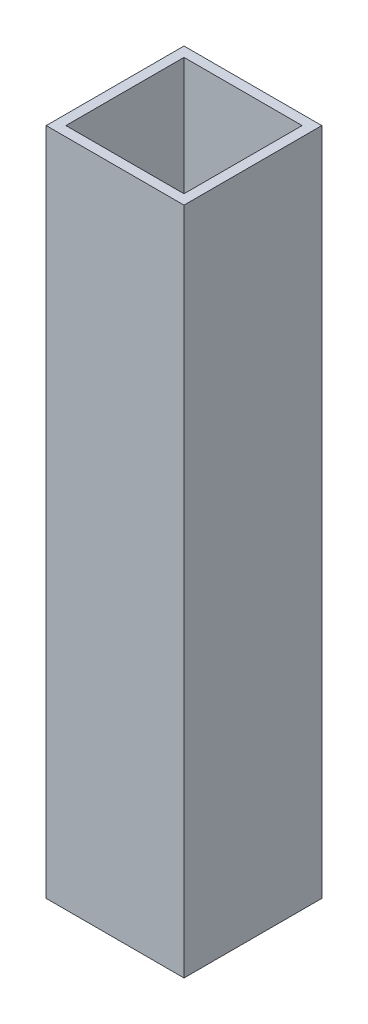
ISO-10303-21;
HEADER;
FILE_DESCRIPTION(('STEP AP214'),'2;1');
FILE_NAME('part.step','',(''),(''),'','','');
FILE_SCHEMA(('AUTOMOTIVE_DESIGN { 1 0 10303 214 1 1 1 1 }'));
ENDSEC;
DATA;
#1=APPLICATION_CONTEXT('core data for automotive mechanical design processes');
#2=APPLICATION_PROTOCOL_DEFINITION('international standard','automotive_design',2000,#1);
#3=PRODUCT_CONTEXT('',#1,'mechanical');
#4=PRODUCT('Part','Part','',(#3));
#5=PRODUCT_RELATED_PRODUCT_CATEGORY('part','',(#4));
#6=PRODUCT_DEFINITION_FORMATION('','',#4);
#7=PRODUCT_DEFINITION_CONTEXT('part definition',#1,'design');
#8=PRODUCT_DEFINITION('design','',#6,#7);
#9=PRODUCT_DEFINITION_SHAPE('','',#8);
#10=(LENGTH_UNIT() NAMED_UNIT(*) SI_UNIT(.MILLI.,.METRE.));
#11=(NAMED_UNIT(*) PLANE_ANGLE_UNIT() SI_UNIT($,.RADIAN.));
#12=(NAMED_UNIT(*) SI_UNIT($,.STERADIAN.) SOLID_ANGLE_UNIT());
#13=UNCERTAINTY_MEASURE_WITH_UNIT(LENGTH_MEASURE(1.E-05),#10,'distance_accuracy_value','');
#14=(GEOMETRIC_REPRESENTATION_CONTEXT(3) GLOBAL_UNCERTAINTY_ASSIGNED_CONTEXT((#13)) GLOBAL_UNIT_ASSIGNED_CONTEXT((#10,
#11,#12)) REPRESENTATION_CONTEXT('',''));
#15=CARTESIAN_POINT('',(0.,0.,0.));
#16=DIRECTION('',(0.,0.,1.));
#17=DIRECTION('',(1.,0.,0.));
#18=AXIS2_PLACEMENT_3D('',#15,#16,#17);
#19=CARTESIAN_POINT('',(1328.7375,260.35,-22.225));
#20=DIRECTION('',(0.,1.,0.));
#21=DIRECTION('',(-1.,0.,0.));
#22=AXIS2_PLACEMENT_3D('',#19,#20,#21);
#23=PLANE('',#22);
#24=DIRECTION('',(-1.,0.,0.));
#25=VECTOR('',#24,1.);
#26=CARTESIAN_POINT('',(2657.475,260.35,0.));
#27=LINE('',#26,#25);
#28=CARTESIAN_POINT('',(44.45,260.35,0.));
#29=VERTEX_POINT('',#28);
#30=CARTESIAN_POINT('',(0.,260.35,0.));
#31=VERTEX_POINT('',#30);
#32=EDGE_CURVE('E142',#29,#31,#27,.T.);
#33=ORIENTED_EDGE('',*,*,#32,.F.);
#34=DIRECTION('',(0.,0.,-1.));
#35=VECTOR('',#34,1.);
#36=CARTESIAN_POINT('',(44.45,260.35,-22.225));
#37=LINE('',#36,#35);
#38=CARTESIAN_POINT('',(44.45,260.35,-44.45));
#39=VERTEX_POINT('',#38);
#40=EDGE_CURVE('E146',#29,#39,#37,.T.);
#41=ORIENTED_EDGE('',*,*,#40,.T.);
#42=DIRECTION('',(-1.,0.,0.));
#43=VECTOR('',#42,1.);
#44=CARTESIAN_POINT('',(2657.475,260.35,-44.45));
#45=LINE('',#44,#43);
#46=CARTESIAN_POINT('',(0.,260.35,-44.45));
#47=VERTEX_POINT('',#46);
#48=EDGE_CURVE('E150',#39,#47,#45,.T.);
#49=ORIENTED_EDGE('',*,*,#48,.T.);
#50=DIRECTION('',(0.,0.,-1.));
#51=VECTOR('',#50,1.);
#52=CARTESIAN_POINT('',(0.,260.35,-22.225));
#53=LINE('',#52,#51);
#54=EDGE_CURVE('E153',#31,#47,#53,.T.);
#55=ORIENTED_EDGE('',*,*,#54,.F.);
#56=EDGE_LOOP('',(#33,#41,#49,#55));
#57=FACE_BOUND('',#56,.T.);
#58=DIRECTION('',(0.,0.,-1.));
#59=VECTOR('',#58,1.);
#60=CARTESIAN_POINT('',(41.275,260.35,-22.225));
#61=LINE('',#60,#59);
#62=CARTESIAN_POINT('',(41.275,260.35,-3.175));
#63=VERTEX_POINT('',#62);
#64=CARTESIAN_POINT('',(41.275,260.35,-41.275));
#65=VERTEX_POINT('',#64);
#66=EDGE_CURVE('E129',#63,#65,#61,.T.);
#67=ORIENTED_EDGE('',*,*,#66,.F.);
#68=DIRECTION('',(-1.,0.,0.));
#69=VECTOR('',#68,1.);
#70=CARTESIAN_POINT('',(2657.475,260.35,-3.175));
#71=LINE('',#70,#69);
#72=CARTESIAN_POINT('',(3.175,260.35,-3.175));
#73=VERTEX_POINT('',#72);
#74=EDGE_CURVE('E123',#63,#73,#71,.T.);
#75=ORIENTED_EDGE('',*,*,#74,.T.);
#76=DIRECTION('',(0.,0.,-1.));
#77=VECTOR('',#76,1.);
#78=CARTESIAN_POINT('',(3.175,260.35,-22.225));
#79=LINE('',#78,#77);
#80=CARTESIAN_POINT('',(3.175,260.35,-41.275));
#81=VERTEX_POINT('',#80);
#82=EDGE_CURVE('E105',#73,#81,#79,.T.);
#83=ORIENTED_EDGE('',*,*,#82,.T.);
#84=DIRECTION('',(-1.,0.,0.));
#85=VECTOR('',#84,1.);
#86=CARTESIAN_POINT('',(2657.475,260.35,-41.275));
#87=LINE('',#86,#85);
#88=EDGE_CURVE('E139',#65,#81,#87,.T.);
#89=ORIENTED_EDGE('',*,*,#88,.F.);
#90=EDGE_LOOP('',(#67,#75,#83,#89));
#91=FACE_BOUND('',#90,.T.);
#92=ADVANCED_FACE('F14',(#57,#91),#23,.T.);
#93=CARTESIAN_POINT('',(1328.7375,44.45,-22.225));
#94=DIRECTION('',(0.,1.,0.));
#95=DIRECTION('',(-1.,0.,0.));
#96=AXIS2_PLACEMENT_3D('',#93,#94,#95);
#97=PLANE('',#96);
#98=DIRECTION('',(-1.,0.,0.));
#99=VECTOR('',#98,1.);
#100=CARTESIAN_POINT('',(2657.475,44.45,0.));
#101=LINE('',#100,#99);
#102=CARTESIAN_POINT('',(44.45,44.45,0.));
#103=VERTEX_POINT('',#102);
#104=CARTESIAN_POINT('',(0.,44.45,0.));
#105=VERTEX_POINT('',#104);
#106=EDGE_CURVE('E158',#103,#105,#101,.T.);
#107=ORIENTED_EDGE('',*,*,#106,.T.);
#108=DIRECTION('',(0.,0.,-1.));
#109=VECTOR('',#108,1.);
#110=CARTESIAN_POINT('',(0.,44.45,-22.225));
#111=LINE('',#110,#109);
#112=CARTESIAN_POINT('',(0.,44.45,-44.45));
#113=VERTEX_POINT('',#112);
#114=EDGE_CURVE('E147',#105,#113,#111,.T.);
#115=ORIENTED_EDGE('',*,*,#114,.T.);
#116=DIRECTION('',(-1.,0.,0.));
#117=VECTOR('',#116,1.);
#118=CARTESIAN_POINT('',(2657.475,44.45,-44.45));
#119=LINE('',#118,#117);
#120=CARTESIAN_POINT('',(44.45,44.45,-44.45));
#121=VERTEX_POINT('',#120);
#122=EDGE_CURVE('E165',#121,#113,#119,.T.);
#123=ORIENTED_EDGE('',*,*,#122,.F.);
#124=DIRECTION('',(0.,0.,-1.));
#125=VECTOR('',#124,1.);
#126=CARTESIAN_POINT('',(44.45,44.45,-22.225));
#127=LINE('',#126,#125);
#128=EDGE_CURVE('E162',#103,#121,#127,.T.);
#129=ORIENTED_EDGE('',*,*,#128,.F.);
#130=EDGE_LOOP('',(#107,#115,#123,#129));
#131=FACE_BOUND('',#130,.T.);
#132=DIRECTION('',(-1.,0.,0.));
#133=VECTOR('',#132,1.);
#134=CARTESIAN_POINT('',(2657.475,44.45,-3.175));
#135=LINE('',#134,#133);
#136=CARTESIAN_POINT('',(41.275,44.45,-3.175));
#137=VERTEX_POINT('',#136);
#138=CARTESIAN_POINT('',(3.175,44.45,-3.175));
#139=VERTEX_POINT('',#138);
#140=EDGE_CURVE('E112',#137,#139,#135,.T.);
#141=ORIENTED_EDGE('',*,*,#140,.F.);
#142=DIRECTION('',(0.,0.,-1.));
#143=VECTOR('',#142,1.);
#144=CARTESIAN_POINT('',(41.275,44.45,-22.225));
#145=LINE('',#144,#143);
#146=CARTESIAN_POINT('',(41.275,44.45,-41.275));
#147=VERTEX_POINT('',#146);
#148=EDGE_CURVE('E119',#137,#147,#145,.T.);
#149=ORIENTED_EDGE('',*,*,#148,.T.);
#150=DIRECTION('',(-1.,0.,0.));
#151=VECTOR('',#150,1.);
#152=CARTESIAN_POINT('',(2657.475,44.45,-41.275));
#153=LINE('',#152,#151);
#154=CARTESIAN_POINT('',(3.175,44.45,-41.275));
#155=VERTEX_POINT('',#154);
#156=EDGE_CURVE('E46',#147,#155,#153,.T.);
#157=ORIENTED_EDGE('',*,*,#156,.T.);
#158=DIRECTION('',(0.,0.,-1.));
#159=VECTOR('',#158,1.);
#160=CARTESIAN_POINT('',(3.175,44.45,-22.225));
#161=LINE('',#160,#159);
#162=EDGE_CURVE('E103',#139,#155,#161,.T.);
#163=ORIENTED_EDGE('',*,*,#162,.F.);
#164=EDGE_LOOP('',(#141,#149,#157,#163));
#165=FACE_BOUND('',#164,.T.);
#166=ADVANCED_FACE('F121',(#131,#165),#97,.F.);
#167=CARTESIAN_POINT('',(2657.475,260.35,0.));
#168=DIRECTION('',(0.,0.,1.));
#169=DIRECTION('',(1.,0.,0.));
#170=AXIS2_PLACEMENT_3D('',#167,#168,#169);
#171=PLANE('',#170);
#172=ORIENTED_EDGE('',*,*,#106,.F.);
#173=DIRECTION('',(0.,-1.,0.));
#174=VECTOR('',#173,1.);
#175=CARTESIAN_POINT('',(44.45,260.35,0.));
#176=LINE('',#175,#174);
#177=EDGE_CURVE('E9',#29,#103,#176,.T.);
#178=ORIENTED_EDGE('',*,*,#177,.F.);
#179=ORIENTED_EDGE('',*,*,#32,.T.);
#180=DIRECTION('',(0.,-1.,0.));
#181=VECTOR('',#180,1.);
#182=CARTESIAN_POINT('',(0.,260.35,0.));
#183=LINE('',#182,#181);
#184=EDGE_CURVE('E157',#31,#105,#183,.T.);
#185=ORIENTED_EDGE('',*,*,#184,.T.);
#186=EDGE_LOOP('',(#172,#178,#179,#185));
#187=FACE_BOUND('',#186,.T.);
#188=ADVANCED_FACE('F16',(#187),#171,.T.);
#189=CARTESIAN_POINT('',(44.45,260.35,-22.225));
#190=DIRECTION('',(-1.,0.,0.));
#191=DIRECTION('',(0.,0.,1.));
#192=AXIS2_PLACEMENT_3D('',#189,#190,#191);
#193=PLANE('',#192);
#194=ORIENTED_EDGE('',*,*,#128,.T.);
#195=DIRECTION('',(0.,-1.,0.));
#196=VECTOR('',#195,1.);
#197=CARTESIAN_POINT('',(44.45,260.35,-44.45));
#198=LINE('',#197,#196);
#199=EDGE_CURVE('E23',#39,#121,#198,.T.);
#200=ORIENTED_EDGE('',*,*,#199,.F.);
#201=ORIENTED_EDGE('',*,*,#40,.F.);
#202=ORIENTED_EDGE('',*,*,#177,.T.);
#203=EDGE_LOOP('',(#194,#200,#201,#202));
#204=FACE_BOUND('',#203,.T.);
#205=ADVANCED_FACE('F197',(#204),#193,.F.);
#206=CARTESIAN_POINT('',(2657.475,260.35,-44.45));
#207=DIRECTION('',(0.,0.,1.));
#208=DIRECTION('',(1.,0.,0.));
#209=AXIS2_PLACEMENT_3D('',#206,#207,#208);
#210=PLANE('',#209);
#211=ORIENTED_EDGE('',*,*,#122,.T.);
#212=DIRECTION('',(0.,-1.,0.));
#213=VECTOR('',#212,1.);
#214=CARTESIAN_POINT('',(0.,260.35,-44.45));
#215=LINE('',#214,#213);
#216=EDGE_CURVE('E174',#47,#113,#215,.T.);
#217=ORIENTED_EDGE('',*,*,#216,.F.);
#218=ORIENTED_EDGE('',*,*,#48,.F.);
#219=ORIENTED_EDGE('',*,*,#199,.T.);
#220=EDGE_LOOP('',(#211,#217,#218,#219));
#221=FACE_BOUND('',#220,.T.);
#222=ADVANCED_FACE('F183',(#221),#210,.F.);
#223=CARTESIAN_POINT('',(0.,260.35,-22.225));
#224=DIRECTION('',(-1.,0.,0.));
#225=DIRECTION('',(0.,0.,1.));
#226=AXIS2_PLACEMENT_3D('',#223,#224,#225);
#227=PLANE('',#226);
#228=ORIENTED_EDGE('',*,*,#114,.F.);
#229=ORIENTED_EDGE('',*,*,#184,.F.);
#230=ORIENTED_EDGE('',*,*,#54,.T.);
#231=ORIENTED_EDGE('',*,*,#216,.T.);
#232=EDGE_LOOP('',(#228,#229,#230,#231));
#233=FACE_BOUND('',#232,.T.);
#234=ADVANCED_FACE('F192',(#233),#227,.T.);
#235=CARTESIAN_POINT('',(2657.475,260.35,-3.175));
#236=DIRECTION('',(0.,0.,1.));
#237=DIRECTION('',(1.,0.,0.));
#238=AXIS2_PLACEMENT_3D('',#235,#236,#237);
#239=PLANE('',#238);
#240=ORIENTED_EDGE('',*,*,#140,.T.);
#241=DIRECTION('',(0.,-1.,0.));
#242=VECTOR('',#241,1.);
#243=CARTESIAN_POINT('',(3.17500000000015,260.35,-3.175));
#244=LINE('',#243,#242);
#245=EDGE_CURVE('E99',#73,#139,#244,.T.);
#246=ORIENTED_EDGE('',*,*,#245,.F.);
#247=ORIENTED_EDGE('',*,*,#74,.F.);
#248=DIRECTION('',(0.,-1.,0.));
#249=VECTOR('',#248,1.);
#250=CARTESIAN_POINT('',(41.275,260.35,-3.175));
#251=LINE('',#250,#249);
#252=EDGE_CURVE('E114',#63,#137,#251,.T.);
#253=ORIENTED_EDGE('',*,*,#252,.T.);
#254=EDGE_LOOP('',(#240,#246,#247,#253));
#255=FACE_BOUND('',#254,.T.);
#256=ADVANCED_FACE('F113',(#255),#239,.F.);
#257=CARTESIAN_POINT('',(41.275,260.35,-22.225));
#258=DIRECTION('',(-1.,0.,0.));
#259=DIRECTION('',(0.,0.,1.));
#260=AXIS2_PLACEMENT_3D('',#257,#258,#259);
#261=PLANE('',#260);
#262=ORIENTED_EDGE('',*,*,#148,.F.);
#263=ORIENTED_EDGE('',*,*,#252,.F.);
#264=ORIENTED_EDGE('',*,*,#66,.T.);
#265=DIRECTION('',(0.,-1.,0.));
#266=VECTOR('',#265,1.);
#267=CARTESIAN_POINT('',(41.275,260.35,-41.275));
#268=LINE('',#267,#266);
#269=EDGE_CURVE('E360',#65,#147,#268,.T.);
#270=ORIENTED_EDGE('',*,*,#269,.T.);
#271=EDGE_LOOP('',(#262,#263,#264,#270));
#272=FACE_BOUND('',#271,.T.);
#273=ADVANCED_FACE('F232',(#272),#261,.T.);
#274=CARTESIAN_POINT('',(2657.475,260.35,-41.275));
#275=DIRECTION('',(0.,0.,1.));
#276=DIRECTION('',(1.,0.,0.));
#277=AXIS2_PLACEMENT_3D('',#274,#275,#276);
#278=PLANE('',#277);
#279=ORIENTED_EDGE('',*,*,#156,.F.);
#280=ORIENTED_EDGE('',*,*,#269,.F.);
#281=ORIENTED_EDGE('',*,*,#88,.T.);
#282=DIRECTION('',(0.,-1.,0.));
#283=VECTOR('',#282,1.);
#284=CARTESIAN_POINT('',(3.17500000000015,260.35,-41.275));
#285=LINE('',#284,#283);
#286=EDGE_CURVE('E35',#81,#155,#285,.T.);
#287=ORIENTED_EDGE('',*,*,#286,.T.);
#288=EDGE_LOOP('',(#279,#280,#281,#287));
#289=FACE_BOUND('',#288,.T.);
#290=ADVANCED_FACE('F239',(#289),#278,.T.);
#291=CARTESIAN_POINT('',(3.175,260.35,-22.225));
#292=DIRECTION('',(-1.,0.,0.));
#293=DIRECTION('',(0.,0.,1.));
#294=AXIS2_PLACEMENT_3D('',#291,#292,#293);
#295=PLANE('',#294);
#296=ORIENTED_EDGE('',*,*,#162,.T.);
#297=ORIENTED_EDGE('',*,*,#286,.F.);
#298=ORIENTED_EDGE('',*,*,#82,.F.);
#299=ORIENTED_EDGE('',*,*,#245,.T.);
#300=EDGE_LOOP('',(#296,#297,#298,#299));
#301=FACE_BOUND('',#300,.T.);
#302=ADVANCED_FACE('F101',(#301),#295,.F.);
#303=CLOSED_SHELL('',(#92,#166,#188,#205,#222,#234,#256,#273,#290,#302));
#304=MANIFOLD_SOLID_BREP('B1',#303);
#305=ADVANCED_BREP_SHAPE_REPRESENTATION('',(#18,#304),#14);
#306=SHAPE_DEFINITION_REPRESENTATION(#9,#305);
ENDSEC;
END-ISO-10303-21;
